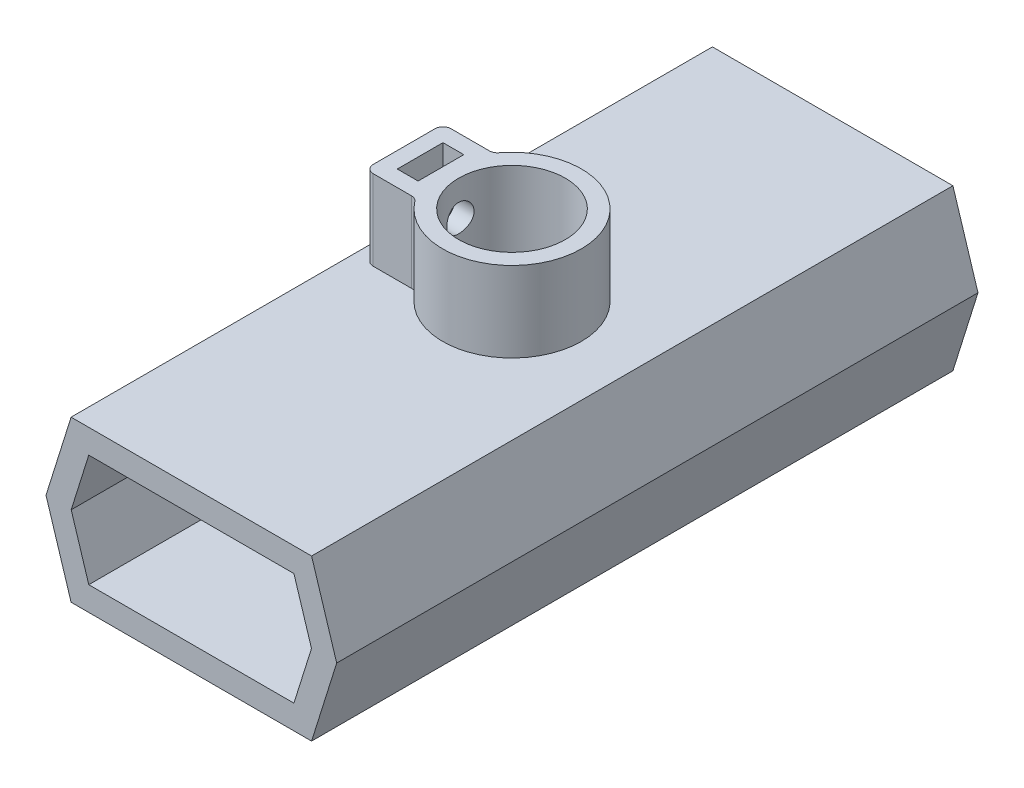
ISO-10303-21;
HEADER;
FILE_DESCRIPTION(('STEP AP214'),'2;1');
FILE_NAME('part.step','',(''),(''),'','','');
FILE_SCHEMA(('AUTOMOTIVE_DESIGN { 1 0 10303 214 1 1 1 1 }'));
ENDSEC;
DATA;
#1=APPLICATION_CONTEXT('core data for automotive mechanical design processes');
#2=APPLICATION_PROTOCOL_DEFINITION('international standard','automotive_design',2000,#1);
#3=PRODUCT_CONTEXT('',#1,'mechanical');
#4=PRODUCT('Part','Part','',(#3));
#5=PRODUCT_RELATED_PRODUCT_CATEGORY('part','',(#4));
#6=PRODUCT_DEFINITION_FORMATION('','',#4);
#7=PRODUCT_DEFINITION_CONTEXT('part definition',#1,'design');
#8=PRODUCT_DEFINITION('design','',#6,#7);
#9=PRODUCT_DEFINITION_SHAPE('','',#8);
#10=(LENGTH_UNIT() NAMED_UNIT(*) SI_UNIT(.MILLI.,.METRE.));
#11=(NAMED_UNIT(*) PLANE_ANGLE_UNIT() SI_UNIT($,.RADIAN.));
#12=(NAMED_UNIT(*) SI_UNIT($,.STERADIAN.) SOLID_ANGLE_UNIT());
#13=UNCERTAINTY_MEASURE_WITH_UNIT(LENGTH_MEASURE(1.E-05),#10,'distance_accuracy_value','');
#14=(GEOMETRIC_REPRESENTATION_CONTEXT(3) GLOBAL_UNCERTAINTY_ASSIGNED_CONTEXT((#13)) GLOBAL_UNIT_ASSIGNED_CONTEXT((#10,
#11,#12)) REPRESENTATION_CONTEXT('',''));
#15=CARTESIAN_POINT('',(0.,0.,0.));
#16=DIRECTION('',(0.,0.,1.));
#17=DIRECTION('',(1.,0.,0.));
#18=AXIS2_PLACEMENT_3D('',#15,#16,#17);
#19=CARTESIAN_POINT('',(-15.,0.,40.));
#20=DIRECTION('',(0.,-1.,0.));
#21=DIRECTION('',(1.,0.,0.));
#22=AXIS2_PLACEMENT_3D('',#19,#20,#21);
#23=PLANE('',#22);
#24=DIRECTION('',(-1.,0.,0.));
#25=VECTOR('',#24,1.);
#26=CARTESIAN_POINT('',(-15.,0.,-40.));
#27=LINE('',#26,#25);
#28=CARTESIAN_POINT('',(15.,0.,-40.));
#29=VERTEX_POINT('',#28);
#30=CARTESIAN_POINT('',(-15.,0.,-40.));
#31=VERTEX_POINT('',#30);
#32=EDGE_CURVE('E295',#29,#31,#27,.T.);
#33=ORIENTED_EDGE('',*,*,#32,.T.);
#34=DIRECTION('',(0.,0.,-1.));
#35=VECTOR('',#34,1.);
#36=CARTESIAN_POINT('',(-15.,0.,40.));
#37=LINE('',#36,#35);
#38=CARTESIAN_POINT('',(-15.,0.,40.));
#39=VERTEX_POINT('',#38);
#40=EDGE_CURVE('E305',#39,#31,#37,.T.);
#41=ORIENTED_EDGE('',*,*,#40,.F.);
#42=DIRECTION('',(-1.,0.,0.));
#43=VECTOR('',#42,1.);
#44=CARTESIAN_POINT('',(-15.,0.,40.));
#45=LINE('',#44,#43);
#46=CARTESIAN_POINT('',(15.,0.,40.));
#47=VERTEX_POINT('',#46);
#48=EDGE_CURVE('E303',#47,#39,#45,.T.);
#49=ORIENTED_EDGE('',*,*,#48,.F.);
#50=DIRECTION('',(0.,0.,-1.));
#51=VECTOR('',#50,1.);
#52=CARTESIAN_POINT('',(15.,0.,40.));
#53=LINE('',#52,#51);
#54=EDGE_CURVE('E319',#47,#29,#53,.T.);
#55=ORIENTED_EDGE('',*,*,#54,.T.);
#56=EDGE_LOOP('',(#33,#41,#49,#55));
#57=FACE_BOUND('',#56,.T.);
#58=DIRECTION('',(-1.,0.,0.));
#59=VECTOR('',#58,1.);
#60=CARTESIAN_POINT('',(0.,0.,-4.85550595548645));
#61=LINE('',#60,#59);
#62=CARTESIAN_POINT('',(-7.67043349526366,0.,-4.85550595548645));
#63=VERTEX_POINT('',#62);
#64=CARTESIAN_POINT('',(-12.461589548446,0.,-4.85550595548645));
#65=VERTEX_POINT('',#64);
#66=EDGE_CURVE('E405',#63,#65,#61,.T.);
#67=ORIENTED_EDGE('',*,*,#66,.F.);
#68=CARTESIAN_POINT('',(-7.67043349526366,0.,-5.85550595548645));
#69=DIRECTION('',(0.,-1.,0.));
#70=DIRECTION('',(1.,0.,0.));
#71=AXIS2_PLACEMENT_3D('',#68,#69,#70);
#72=CIRCLE('',#71,1.);
#73=CARTESIAN_POINT('',(-6.87556992062494,0.,-5.24871777357076));
#74=VERTEX_POINT('',#73);
#75=EDGE_CURVE('E351',#63,#74,#72,.F.);
#76=ORIENTED_EDGE('',*,*,#75,.T.);
#77=CARTESIAN_POINT('',(0.,0.,0.));
#78=DIRECTION('',(0.,-1.,0.));
#79=DIRECTION('',(1.,0.,0.));
#80=AXIS2_PLACEMENT_3D('',#77,#78,#79);
#81=CIRCLE('',#80,8.65);
#82=CARTESIAN_POINT('',(-6.87556992062494,0.,5.24871777357076));
#83=VERTEX_POINT('',#82);
#84=EDGE_CURVE('E334',#83,#74,#81,.F.);
#85=ORIENTED_EDGE('',*,*,#84,.F.);
#86=CARTESIAN_POINT('',(-7.67043349526366,0.,5.85550595548645));
#87=DIRECTION('',(0.,-1.,0.));
#88=DIRECTION('',(1.,0.,0.));
#89=AXIS2_PLACEMENT_3D('',#86,#87,#88);
#90=CIRCLE('',#89,1.);
#91=CARTESIAN_POINT('',(-7.67043349526366,0.,4.85550595548645));
#92=VERTEX_POINT('',#91);
#93=EDGE_CURVE('E349',#83,#92,#90,.F.);
#94=ORIENTED_EDGE('',*,*,#93,.T.);
#95=DIRECTION('',(1.,0.,0.));
#96=VECTOR('',#95,1.);
#97=CARTESIAN_POINT('',(0.,0.,4.85550595548645));
#98=LINE('',#97,#96);
#99=CARTESIAN_POINT('',(-12.461589548446,0.,4.85550595548645));
#100=VERTEX_POINT('',#99);
#101=EDGE_CURVE('E379',#100,#92,#98,.T.);
#102=ORIENTED_EDGE('',*,*,#101,.F.);
#103=CARTESIAN_POINT('',(-12.461589548446,0.,3.85550595548645));
#104=DIRECTION('',(0.,-1.,0.));
#105=DIRECTION('',(1.,0.,0.));
#106=AXIS2_PLACEMENT_3D('',#103,#104,#105);
#107=CIRCLE('',#106,1.);
#108=CARTESIAN_POINT('',(-13.461589548446,0.,3.85550595548645));
#109=VERTEX_POINT('',#108);
#110=EDGE_CURVE('E45',#100,#109,#107,.T.);
#111=ORIENTED_EDGE('',*,*,#110,.T.);
#112=DIRECTION('',(0.,0.,1.));
#113=VECTOR('',#112,1.);
#114=CARTESIAN_POINT('',(-13.461589548446,0.,0.));
#115=LINE('',#114,#113);
#116=CARTESIAN_POINT('',(-13.461589548446,0.,-3.85550595548645));
#117=VERTEX_POINT('',#116);
#118=EDGE_CURVE('E378',#117,#109,#115,.T.);
#119=ORIENTED_EDGE('',*,*,#118,.F.);
#120=CARTESIAN_POINT('',(-12.461589548446,0.,-3.85550595548645));
#121=DIRECTION('',(0.,-1.,0.));
#122=DIRECTION('',(1.,0.,0.));
#123=AXIS2_PLACEMENT_3D('',#120,#121,#122);
#124=CIRCLE('',#123,1.);
#125=EDGE_CURVE('E372',#117,#65,#124,.T.);
#126=ORIENTED_EDGE('',*,*,#125,.T.);
#127=EDGE_LOOP('',(#67,#76,#85,#94,#102,#111,#119,#126));
#128=FACE_BOUND('',#127,.T.);
#129=ADVANCED_FACE('F37',(#57,#128),#23,.F.);
#130=CARTESIAN_POINT('',(0.,10.,0.));
#131=DIRECTION('',(0.,-1.,0.));
#132=DIRECTION('',(1.,0.,0.));
#133=AXIS2_PLACEMENT_3D('',#130,#131,#132);
#134=CYLINDRICAL_SURFACE('',#133,8.65);
#135=ORIENTED_EDGE('',*,*,#84,.T.);
#136=DIRECTION('',(0.,-1.,0.));
#137=VECTOR('',#136,1.);
#138=CARTESIAN_POINT('',(-6.87556992062495,10.,-5.24871777357076));
#139=LINE('',#138,#137);
#140=CARTESIAN_POINT('',(-6.87556992062495,10.,-5.24871777357076));
#141=VERTEX_POINT('',#140);
#142=EDGE_CURVE('E356',#74,#141,#139,.F.);
#143=ORIENTED_EDGE('',*,*,#142,.T.);
#144=CARTESIAN_POINT('',(0.,10.,0.));
#145=DIRECTION('',(0.,1.,0.));
#146=DIRECTION('',(-1.,0.,0.));
#147=AXIS2_PLACEMENT_3D('',#144,#145,#146);
#148=CIRCLE('',#147,8.65);
#149=CARTESIAN_POINT('',(-6.87556992062495,10.,5.24871777357076));
#150=VERTEX_POINT('',#149);
#151=EDGE_CURVE('E227',#150,#141,#148,.T.);
#152=ORIENTED_EDGE('',*,*,#151,.F.);
#153=DIRECTION('',(0.,-1.,0.));
#154=VECTOR('',#153,1.);
#155=CARTESIAN_POINT('',(-6.87556992062495,10.,5.24871777357076));
#156=LINE('',#155,#154);
#157=EDGE_CURVE('E353',#150,#83,#156,.T.);
#158=ORIENTED_EDGE('',*,*,#157,.T.);
#159=EDGE_LOOP('',(#135,#143,#152,#158));
#160=FACE_BOUND('',#159,.T.);
#161=ADVANCED_FACE('F437',(#160),#134,.T.);
#162=CARTESIAN_POINT('',(-18.130448736,-10.,40.));
#163=DIRECTION('',(0.954331820555923,-0.298748684138387,0.));
#164=DIRECTION('',(0.298748684138387,0.954331820555923,0.));
#165=AXIS2_PLACEMENT_3D('',#162,#163,#164);
#166=PLANE('',#165);
#167=DIRECTION('',(-0.298748684138387,-0.954331820555923,0.));
#168=VECTOR('',#167,1.);
#169=CARTESIAN_POINT('',(-18.130448736,-10.,-40.));
#170=LINE('',#169,#168);
#171=CARTESIAN_POINT('',(-18.130448736,-10.,-40.));
#172=VERTEX_POINT('',#171);
#173=EDGE_CURVE('E280',#31,#172,#170,.T.);
#174=ORIENTED_EDGE('',*,*,#173,.T.);
#175=DIRECTION('',(0.,0.,-1.));
#176=VECTOR('',#175,1.);
#177=CARTESIAN_POINT('',(-18.130448736,-10.,40.));
#178=LINE('',#177,#176);
#179=CARTESIAN_POINT('',(-18.130448736,-10.,40.));
#180=VERTEX_POINT('',#179);
#181=EDGE_CURVE('E331',#180,#172,#178,.T.);
#182=ORIENTED_EDGE('',*,*,#181,.F.);
#183=DIRECTION('',(-0.298748684138387,-0.954331820555923,0.));
#184=VECTOR('',#183,1.);
#185=CARTESIAN_POINT('',(-18.130448736,-10.,40.));
#186=LINE('',#185,#184);
#187=EDGE_CURVE('E291',#39,#180,#186,.T.);
#188=ORIENTED_EDGE('',*,*,#187,.F.);
#189=ORIENTED_EDGE('',*,*,#40,.T.);
#190=EDGE_LOOP('',(#174,#182,#188,#189));
#191=FACE_BOUND('',#190,.T.);
#192=ADVANCED_FACE('F444',(#191),#166,.F.);
#193=CARTESIAN_POINT('',(-15.,-20.,40.));
#194=DIRECTION('',(0.954331820555923,0.298748684138387,0.));
#195=DIRECTION('',(-0.298748684138387,0.954331820555923,0.));
#196=AXIS2_PLACEMENT_3D('',#193,#194,#195);
#197=PLANE('',#196);
#198=DIRECTION('',(0.298748684138387,-0.954331820555923,0.));
#199=VECTOR('',#198,1.);
#200=CARTESIAN_POINT('',(-15.,-20.,-40.));
#201=LINE('',#200,#199);
#202=CARTESIAN_POINT('',(-15.,-20.,-40.));
#203=VERTEX_POINT('',#202);
#204=EDGE_CURVE('E308',#172,#203,#201,.T.);
#205=ORIENTED_EDGE('',*,*,#204,.T.);
#206=DIRECTION('',(0.,0.,-1.));
#207=VECTOR('',#206,1.);
#208=CARTESIAN_POINT('',(-15.,-20.,40.));
#209=LINE('',#208,#207);
#210=CARTESIAN_POINT('',(-15.,-20.,40.));
#211=VERTEX_POINT('',#210);
#212=EDGE_CURVE('E328',#211,#203,#209,.T.);
#213=ORIENTED_EDGE('',*,*,#212,.F.);
#214=DIRECTION('',(0.298748684138387,-0.954331820555923,0.));
#215=VECTOR('',#214,1.);
#216=CARTESIAN_POINT('',(-15.,-20.,40.));
#217=LINE('',#216,#215);
#218=EDGE_CURVE('E294',#180,#211,#217,.T.);
#219=ORIENTED_EDGE('',*,*,#218,.F.);
#220=ORIENTED_EDGE('',*,*,#181,.T.);
#221=EDGE_LOOP('',(#205,#213,#219,#220));
#222=FACE_BOUND('',#221,.T.);
#223=ADVANCED_FACE('F542',(#222),#197,.F.);
#224=CARTESIAN_POINT('',(15.,-20.,40.));
#225=DIRECTION('',(0.,1.,0.));
#226=DIRECTION('',(0.,0.,1.));
#227=AXIS2_PLACEMENT_3D('',#224,#225,#226);
#228=PLANE('',#227);
#229=CARTESIAN_POINT('',(0.,-20.,0.));
#230=DIRECTION('',(0.,1.,0.));
#231=DIRECTION('',(-1.,0.,0.));
#232=AXIS2_PLACEMENT_3D('',#229,#230,#231);
#233=CIRCLE('',#232,6.65);
#234=CARTESIAN_POINT('',(-6.65,-20.,0.));
#235=VERTEX_POINT('',#234);
#236=EDGE_CURVE('E235',#235,#235,#233,.T.);
#237=ORIENTED_EDGE('',*,*,#236,.T.);
#238=EDGE_LOOP('',(#237));
#239=FACE_BOUND('',#238,.T.);
#240=DIRECTION('',(1.,0.,0.));
#241=VECTOR('',#240,1.);
#242=CARTESIAN_POINT('',(15.,-20.,-40.));
#243=LINE('',#242,#241);
#244=CARTESIAN_POINT('',(15.,-20.,-40.));
#245=VERTEX_POINT('',#244);
#246=EDGE_CURVE('E310',#203,#245,#243,.T.);
#247=ORIENTED_EDGE('',*,*,#246,.T.);
#248=DIRECTION('',(0.,0.,-1.));
#249=VECTOR('',#248,1.);
#250=CARTESIAN_POINT('',(15.,-20.,40.));
#251=LINE('',#250,#249);
#252=CARTESIAN_POINT('',(15.,-20.,40.));
#253=VERTEX_POINT('',#252);
#254=EDGE_CURVE('E325',#253,#245,#251,.T.);
#255=ORIENTED_EDGE('',*,*,#254,.F.);
#256=DIRECTION('',(1.,0.,0.));
#257=VECTOR('',#256,1.);
#258=CARTESIAN_POINT('',(15.,-20.,40.));
#259=LINE('',#258,#257);
#260=EDGE_CURVE('E297',#211,#253,#259,.T.);
#261=ORIENTED_EDGE('',*,*,#260,.F.);
#262=ORIENTED_EDGE('',*,*,#212,.T.);
#263=EDGE_LOOP('',(#247,#255,#261,#262));
#264=FACE_BOUND('',#263,.T.);
#265=ADVANCED_FACE('F539',(#239,#264),#228,.F.);
#266=CARTESIAN_POINT('',(18.130448736,-10.,40.));
#267=DIRECTION('',(-0.954331820555923,0.298748684138387,0.));
#268=DIRECTION('',(-0.298748684138387,-0.954331820555923,0.));
#269=AXIS2_PLACEMENT_3D('',#266,#267,#268);
#270=PLANE('',#269);
#271=DIRECTION('',(0.298748684138387,0.954331820555923,0.));
#272=VECTOR('',#271,1.);
#273=CARTESIAN_POINT('',(18.130448736,-10.,-40.));
#274=LINE('',#273,#272);
#275=CARTESIAN_POINT('',(18.130448736,-10.,-40.));
#276=VERTEX_POINT('',#275);
#277=EDGE_CURVE('E312',#245,#276,#274,.T.);
#278=ORIENTED_EDGE('',*,*,#277,.T.);
#279=DIRECTION('',(0.,0.,-1.));
#280=VECTOR('',#279,1.);
#281=CARTESIAN_POINT('',(18.130448736,-10.,40.));
#282=LINE('',#281,#280);
#283=CARTESIAN_POINT('',(18.130448736,-10.,40.));
#284=VERTEX_POINT('',#283);
#285=EDGE_CURVE('E322',#284,#276,#282,.T.);
#286=ORIENTED_EDGE('',*,*,#285,.F.);
#287=DIRECTION('',(0.298748684138387,0.954331820555923,0.));
#288=VECTOR('',#287,1.);
#289=CARTESIAN_POINT('',(18.130448736,-10.,40.));
#290=LINE('',#289,#288);
#291=EDGE_CURVE('E299',#253,#284,#290,.T.);
#292=ORIENTED_EDGE('',*,*,#291,.F.);
#293=ORIENTED_EDGE('',*,*,#254,.T.);
#294=EDGE_LOOP('',(#278,#286,#292,#293));
#295=FACE_BOUND('',#294,.T.);
#296=ADVANCED_FACE('F534',(#295),#270,.F.);
#297=CARTESIAN_POINT('',(15.,0.,40.));
#298=DIRECTION('',(-0.954331820555923,-0.298748684138387,0.));
#299=DIRECTION('',(0.298748684138387,-0.954331820555923,0.));
#300=AXIS2_PLACEMENT_3D('',#297,#298,#299);
#301=PLANE('',#300);
#302=DIRECTION('',(-0.298748684138387,0.954331820555923,0.));
#303=VECTOR('',#302,1.);
#304=CARTESIAN_POINT('',(15.,0.,-40.));
#305=LINE('',#304,#303);
#306=EDGE_CURVE('E314',#276,#29,#305,.T.);
#307=ORIENTED_EDGE('',*,*,#306,.T.);
#308=ORIENTED_EDGE('',*,*,#54,.F.);
#309=DIRECTION('',(-0.298748684138387,0.954331820555923,0.));
#310=VECTOR('',#309,1.);
#311=CARTESIAN_POINT('',(15.,0.,40.));
#312=LINE('',#311,#310);
#313=EDGE_CURVE('E301',#284,#47,#312,.T.);
#314=ORIENTED_EDGE('',*,*,#313,.F.);
#315=ORIENTED_EDGE('',*,*,#285,.T.);
#316=EDGE_LOOP('',(#307,#308,#314,#315));
#317=FACE_BOUND('',#316,.T.);
#318=ADVANCED_FACE('F509',(#317),#301,.F.);
#319=CARTESIAN_POINT('',(0.,0.,40.));
#320=DIRECTION('',(0.,0.,-1.));
#321=DIRECTION('',(-1.,0.,0.));
#322=AXIS2_PLACEMENT_3D('',#319,#320,#321);
#323=PLANE('',#322);
#324=DIRECTION('',(-1.,0.,0.));
#325=VECTOR('',#324,1.);
#326=CARTESIAN_POINT('',(12.7955739269394,-17.,40.));
#327=LINE('',#326,#325);
#328=CARTESIAN_POINT('',(12.7955739269394,-17.,40.));
#329=VERTEX_POINT('',#328);
#330=CARTESIAN_POINT('',(-12.7955739269394,-17.,40.));
#331=VERTEX_POINT('',#330);
#332=EDGE_CURVE('E259',#329,#331,#327,.T.);
#333=ORIENTED_EDGE('',*,*,#332,.T.);
#334=DIRECTION('',(-0.298748684138387,0.954331820555923,0.));
#335=VECTOR('',#334,1.);
#336=CARTESIAN_POINT('',(-12.7955739269394,-17.,40.));
#337=LINE('',#336,#335);
#338=CARTESIAN_POINT('',(-14.9868880421394,-10.,40.));
#339=VERTEX_POINT('',#338);
#340=EDGE_CURVE('E243',#331,#339,#337,.T.);
#341=ORIENTED_EDGE('',*,*,#340,.T.);
#342=DIRECTION('',(0.298748684138387,0.954331820555923,0.));
#343=VECTOR('',#342,1.);
#344=CARTESIAN_POINT('',(-14.9868880421394,-10.,40.));
#345=LINE('',#344,#343);
#346=CARTESIAN_POINT('',(-12.7955739269394,-3.,40.));
#347=VERTEX_POINT('',#346);
#348=EDGE_CURVE('E246',#339,#347,#345,.T.);
#349=ORIENTED_EDGE('',*,*,#348,.T.);
#350=DIRECTION('',(1.,0.,0.));
#351=VECTOR('',#350,1.);
#352=CARTESIAN_POINT('',(-12.7955739269394,-3.,40.));
#353=LINE('',#352,#351);
#354=CARTESIAN_POINT('',(12.7955739269394,-3.,40.));
#355=VERTEX_POINT('',#354);
#356=EDGE_CURVE('E250',#347,#355,#353,.T.);
#357=ORIENTED_EDGE('',*,*,#356,.T.);
#358=DIRECTION('',(0.298748684138387,-0.954331820555923,0.));
#359=VECTOR('',#358,1.);
#360=CARTESIAN_POINT('',(12.7955739269394,-3.,40.));
#361=LINE('',#360,#359);
#362=CARTESIAN_POINT('',(14.9868880421394,-10.,40.));
#363=VERTEX_POINT('',#362);
#364=EDGE_CURVE('E253',#355,#363,#361,.T.);
#365=ORIENTED_EDGE('',*,*,#364,.T.);
#366=DIRECTION('',(-0.298748684138387,-0.954331820555923,0.));
#367=VECTOR('',#366,1.);
#368=CARTESIAN_POINT('',(14.9868880421394,-10.,40.));
#369=LINE('',#368,#367);
#370=EDGE_CURVE('E256',#363,#329,#369,.T.);
#371=ORIENTED_EDGE('',*,*,#370,.T.);
#372=EDGE_LOOP('',(#333,#341,#349,#357,#365,#371));
#373=FACE_BOUND('',#372,.T.);
#374=ORIENTED_EDGE('',*,*,#187,.T.);
#375=ORIENTED_EDGE('',*,*,#218,.T.);
#376=ORIENTED_EDGE('',*,*,#260,.T.);
#377=ORIENTED_EDGE('',*,*,#291,.T.);
#378=ORIENTED_EDGE('',*,*,#313,.T.);
#379=ORIENTED_EDGE('',*,*,#48,.T.);
#380=EDGE_LOOP('',(#374,#375,#376,#377,#378,#379));
#381=FACE_BOUND('',#380,.T.);
#382=ADVANCED_FACE('F507',(#373,#381),#323,.F.);
#383=CARTESIAN_POINT('',(0.,0.,-40.));
#384=DIRECTION('',(0.,0.,-1.));
#385=DIRECTION('',(-1.,0.,0.));
#386=AXIS2_PLACEMENT_3D('',#383,#384,#385);
#387=PLANE('',#386);
#388=DIRECTION('',(-0.298748684138387,0.954331820555923,0.));
#389=VECTOR('',#388,1.);
#390=CARTESIAN_POINT('',(-12.7955739269394,-17.,-40.));
#391=LINE('',#390,#389);
#392=CARTESIAN_POINT('',(-12.7955739269394,-17.,-40.));
#393=VERTEX_POINT('',#392);
#394=CARTESIAN_POINT('',(-14.9868880421394,-10.,-40.));
#395=VERTEX_POINT('',#394);
#396=EDGE_CURVE('E242',#393,#395,#391,.T.);
#397=ORIENTED_EDGE('',*,*,#396,.F.);
#398=DIRECTION('',(-1.,0.,0.));
#399=VECTOR('',#398,1.);
#400=CARTESIAN_POINT('',(12.7955739269394,-17.,-40.));
#401=LINE('',#400,#399);
#402=CARTESIAN_POINT('',(12.7955739269394,-17.,-40.));
#403=VERTEX_POINT('',#402);
#404=EDGE_CURVE('E247',#403,#393,#401,.T.);
#405=ORIENTED_EDGE('',*,*,#404,.F.);
#406=DIRECTION('',(-0.298748684138387,-0.954331820555923,0.));
#407=VECTOR('',#406,1.);
#408=CARTESIAN_POINT('',(14.9868880421394,-10.,-40.));
#409=LINE('',#408,#407);
#410=CARTESIAN_POINT('',(14.9868880421394,-10.,-40.));
#411=VERTEX_POINT('',#410);
#412=EDGE_CURVE('E273',#411,#403,#409,.T.);
#413=ORIENTED_EDGE('',*,*,#412,.F.);
#414=DIRECTION('',(0.298748684138387,-0.954331820555923,0.));
#415=VECTOR('',#414,1.);
#416=CARTESIAN_POINT('',(12.7955739269394,-3.,-40.));
#417=LINE('',#416,#415);
#418=CARTESIAN_POINT('',(12.7955739269394,-3.,-40.));
#419=VERTEX_POINT('',#418);
#420=EDGE_CURVE('E270',#419,#411,#417,.T.);
#421=ORIENTED_EDGE('',*,*,#420,.F.);
#422=DIRECTION('',(1.,0.,0.));
#423=VECTOR('',#422,1.);
#424=CARTESIAN_POINT('',(-12.7955739269394,-3.,-40.));
#425=LINE('',#424,#423);
#426=CARTESIAN_POINT('',(-12.7955739269394,-3.,-40.));
#427=VERTEX_POINT('',#426);
#428=EDGE_CURVE('E267',#427,#419,#425,.T.);
#429=ORIENTED_EDGE('',*,*,#428,.F.);
#430=DIRECTION('',(0.298748684138387,0.954331820555923,0.));
#431=VECTOR('',#430,1.);
#432=CARTESIAN_POINT('',(-14.9868880421394,-10.,-40.));
#433=LINE('',#432,#431);
#434=EDGE_CURVE('E264',#395,#427,#433,.T.);
#435=ORIENTED_EDGE('',*,*,#434,.F.);
#436=EDGE_LOOP('',(#397,#405,#413,#421,#429,#435));
#437=FACE_BOUND('',#436,.T.);
#438=ORIENTED_EDGE('',*,*,#173,.F.);
#439=ORIENTED_EDGE('',*,*,#32,.F.);
#440=ORIENTED_EDGE('',*,*,#306,.F.);
#441=ORIENTED_EDGE('',*,*,#277,.F.);
#442=ORIENTED_EDGE('',*,*,#246,.F.);
#443=ORIENTED_EDGE('',*,*,#204,.F.);
#444=EDGE_LOOP('',(#438,#439,#440,#441,#442,#443));
#445=FACE_BOUND('',#444,.T.);
#446=ADVANCED_FACE('F505',(#437,#445),#387,.T.);
#447=CARTESIAN_POINT('',(-12.7955739269394,-17.,40.));
#448=DIRECTION('',(-0.954331820555923,-0.298748684138387,0.));
#449=DIRECTION('',(0.298748684138387,-0.954331820555923,0.));
#450=AXIS2_PLACEMENT_3D('',#447,#448,#449);
#451=PLANE('',#450);
#452=ORIENTED_EDGE('',*,*,#396,.T.);
#453=DIRECTION('',(0.,0.,-1.));
#454=VECTOR('',#453,1.);
#455=CARTESIAN_POINT('',(-14.9868880421394,-10.,40.));
#456=LINE('',#455,#454);
#457=EDGE_CURVE('E262',#339,#395,#456,.T.);
#458=ORIENTED_EDGE('',*,*,#457,.F.);
#459=ORIENTED_EDGE('',*,*,#340,.F.);
#460=DIRECTION('',(0.,0.,-1.));
#461=VECTOR('',#460,1.);
#462=CARTESIAN_POINT('',(-12.7955739269394,-17.,40.));
#463=LINE('',#462,#461);
#464=EDGE_CURVE('E278',#331,#393,#463,.T.);
#465=ORIENTED_EDGE('',*,*,#464,.T.);
#466=EDGE_LOOP('',(#452,#458,#459,#465));
#467=FACE_BOUND('',#466,.T.);
#468=ADVANCED_FACE('F486',(#467),#451,.F.);
#469=CARTESIAN_POINT('',(12.7955739269394,-17.,40.));
#470=DIRECTION('',(0.,-1.,0.));
#471=DIRECTION('',(0.,0.,-1.));
#472=AXIS2_PLACEMENT_3D('',#469,#470,#471);
#473=PLANE('',#472);
#474=CARTESIAN_POINT('',(0.,-17.,0.));
#475=DIRECTION('',(0.,-1.,0.));
#476=DIRECTION('',(0.,0.,-1.));
#477=AXIS2_PLACEMENT_3D('',#474,#475,#476);
#478=CIRCLE('',#477,6.65);
#479=CARTESIAN_POINT('',(0.,-17.,-6.65));
#480=VERTEX_POINT('',#479);
#481=EDGE_CURVE('E239',#480,#480,#478,.T.);
#482=ORIENTED_EDGE('',*,*,#481,.T.);
#483=EDGE_LOOP('',(#482));
#484=FACE_BOUND('',#483,.T.);
#485=ORIENTED_EDGE('',*,*,#404,.T.);
#486=ORIENTED_EDGE('',*,*,#464,.F.);
#487=ORIENTED_EDGE('',*,*,#332,.F.);
#488=DIRECTION('',(0.,0.,-1.));
#489=VECTOR('',#488,1.);
#490=CARTESIAN_POINT('',(12.7955739269394,-17.,40.));
#491=LINE('',#490,#489);
#492=EDGE_CURVE('E281',#329,#403,#491,.T.);
#493=ORIENTED_EDGE('',*,*,#492,.T.);
#494=EDGE_LOOP('',(#485,#486,#487,#493));
#495=FACE_BOUND('',#494,.T.);
#496=ADVANCED_FACE('F482',(#484,#495),#473,.F.);
#497=CARTESIAN_POINT('',(14.9868880421394,-10.,40.));
#498=DIRECTION('',(0.954331820555923,-0.298748684138387,0.));
#499=DIRECTION('',(0.298748684138387,0.954331820555923,0.));
#500=AXIS2_PLACEMENT_3D('',#497,#498,#499);
#501=PLANE('',#500);
#502=ORIENTED_EDGE('',*,*,#412,.T.);
#503=ORIENTED_EDGE('',*,*,#492,.F.);
#504=ORIENTED_EDGE('',*,*,#370,.F.);
#505=DIRECTION('',(0.,0.,-1.));
#506=VECTOR('',#505,1.);
#507=CARTESIAN_POINT('',(14.9868880421394,-10.,40.));
#508=LINE('',#507,#506);
#509=EDGE_CURVE('E283',#363,#411,#508,.T.);
#510=ORIENTED_EDGE('',*,*,#509,.T.);
#511=EDGE_LOOP('',(#502,#503,#504,#510));
#512=FACE_BOUND('',#511,.T.);
#513=ADVANCED_FACE('F485',(#512),#501,.F.);
#514=CARTESIAN_POINT('',(12.7955739269394,-3.,40.));
#515=DIRECTION('',(0.954331820555923,0.298748684138387,0.));
#516=DIRECTION('',(-0.298748684138387,0.954331820555923,0.));
#517=AXIS2_PLACEMENT_3D('',#514,#515,#516);
#518=PLANE('',#517);
#519=ORIENTED_EDGE('',*,*,#420,.T.);
#520=ORIENTED_EDGE('',*,*,#509,.F.);
#521=ORIENTED_EDGE('',*,*,#364,.F.);
#522=DIRECTION('',(0.,0.,-1.));
#523=VECTOR('',#522,1.);
#524=CARTESIAN_POINT('',(12.7955739269394,-3.,40.));
#525=LINE('',#524,#523);
#526=EDGE_CURVE('E285',#355,#419,#525,.T.);
#527=ORIENTED_EDGE('',*,*,#526,.T.);
#528=EDGE_LOOP('',(#519,#520,#521,#527));
#529=FACE_BOUND('',#528,.T.);
#530=ADVANCED_FACE('F490',(#529),#518,.F.);
#531=CARTESIAN_POINT('',(-12.7955739269394,-3.,40.));
#532=DIRECTION('',(0.,1.,0.));
#533=DIRECTION('',(-1.,0.,0.));
#534=AXIS2_PLACEMENT_3D('',#531,#532,#533);
#535=PLANE('',#534);
#536=CARTESIAN_POINT('',(0.,-3.,0.));
#537=DIRECTION('',(0.,1.,0.));
#538=DIRECTION('',(-1.,0.,0.));
#539=AXIS2_PLACEMENT_3D('',#536,#537,#538);
#540=CIRCLE('',#539,6.65);
#541=CARTESIAN_POINT('',(-6.65,-3.,0.));
#542=VERTEX_POINT('',#541);
#543=EDGE_CURVE('E238',#542,#542,#540,.T.);
#544=ORIENTED_EDGE('',*,*,#543,.T.);
#545=EDGE_LOOP('',(#544));
#546=FACE_BOUND('',#545,.T.);
#547=ORIENTED_EDGE('',*,*,#428,.T.);
#548=ORIENTED_EDGE('',*,*,#526,.F.);
#549=ORIENTED_EDGE('',*,*,#356,.F.);
#550=DIRECTION('',(0.,0.,-1.));
#551=VECTOR('',#550,1.);
#552=CARTESIAN_POINT('',(-12.7955739269394,-3.,40.));
#553=LINE('',#552,#551);
#554=EDGE_CURVE('E287',#347,#427,#553,.T.);
#555=ORIENTED_EDGE('',*,*,#554,.T.);
#556=EDGE_LOOP('',(#547,#548,#549,#555));
#557=FACE_BOUND('',#556,.T.);
#558=ADVANCED_FACE('F494',(#546,#557),#535,.F.);
#559=CARTESIAN_POINT('',(-14.9868880421394,-10.,40.));
#560=DIRECTION('',(-0.954331820555923,0.298748684138387,0.));
#561=DIRECTION('',(-0.298748684138387,-0.954331820555923,0.));
#562=AXIS2_PLACEMENT_3D('',#559,#560,#561);
#563=PLANE('',#562);
#564=ORIENTED_EDGE('',*,*,#434,.T.);
#565=ORIENTED_EDGE('',*,*,#554,.F.);
#566=ORIENTED_EDGE('',*,*,#348,.F.);
#567=ORIENTED_EDGE('',*,*,#457,.T.);
#568=EDGE_LOOP('',(#564,#565,#566,#567));
#569=FACE_BOUND('',#568,.T.);
#570=ADVANCED_FACE('F498',(#569),#563,.F.);
#571=CARTESIAN_POINT('',(0.,-20.,0.));
#572=DIRECTION('',(0.,1.,0.));
#573=DIRECTION('',(-1.,0.,0.));
#574=AXIS2_PLACEMENT_3D('',#571,#572,#573);
#575=CYLINDRICAL_SURFACE('',#574,6.65);
#576=CARTESIAN_POINT('',(-6.65,3.98467840121392,0.));
#577=CARTESIAN_POINT('',(-6.64999846288474,3.98468090659545,0.0938566019093911));
#578=CARTESIAN_POINT('',(-6.64799327694206,3.99247722251695,0.187740796494141));
#579=CARTESIAN_POINT('',(-6.64018863345844,4.02340698044077,0.372813869582888));
#580=CARTESIAN_POINT('',(-6.63438713337203,4.04654867886772,0.464001269499549));
#581=CARTESIAN_POINT('',(-6.61963159420754,4.10737464671073,0.640981793265625));
#582=CARTESIAN_POINT('',(-6.61068143521243,4.14504102287611,0.726781403803893));
#583=CARTESIAN_POINT('',(-6.5905793371364,4.23378305467132,0.89084464128081));
#584=CARTESIAN_POINT('',(-6.57942729940969,4.28485931110741,0.969107930352961));
#585=CARTESIAN_POINT('',(-6.55586235964077,4.40012879447121,1.11755636953394));
#586=CARTESIAN_POINT('',(-6.54342929921283,4.46455585466091,1.1875567568069));
#587=CARTESIAN_POINT('',(-6.51883601795243,4.60419771990331,1.31588583056865));
#588=CARTESIAN_POINT('',(-6.50667582946536,4.67941379612267,1.37421313978787));
#589=CARTESIAN_POINT('',(-6.48380090955579,4.83994650801201,1.47841986753864));
#590=CARTESIAN_POINT('',(-6.4731117180036,4.92540254136188,1.52409065866378));
#591=CARTESIAN_POINT('',(-6.45468384975293,5.10309698621248,1.60034557365601));
#592=CARTESIAN_POINT('',(-6.44694467763619,5.19533425578442,1.63093223096536));
#593=CARTESIAN_POINT('',(-6.43550060509725,5.38193633753783,1.67551655161871));
#594=CARTESIAN_POINT('',(-6.43171481980235,5.47621647589808,1.68984735454172));
#595=CARTESIAN_POINT('',(-6.42836419830776,5.66591289564242,1.70255116210366));
#596=CARTESIAN_POINT('',(-6.4287986419293,5.76132898040253,1.70092688946329));
#597=CARTESIAN_POINT('',(-6.43376678867655,5.94802009338716,1.68203201220464));
#598=CARTESIAN_POINT('',(-6.43819595283773,6.0393387221455,1.66516039704835));
#599=CARTESIAN_POINT('',(-6.45048762490474,6.21780428782848,1.61688708127688));
#600=CARTESIAN_POINT('',(-6.45835038731881,6.30495091498088,1.58548430355964));
#601=CARTESIAN_POINT('',(-6.47671793050963,6.47365865324831,1.50870502618911));
#602=CARTESIAN_POINT('',(-6.48724956713025,6.55515156384865,1.46318536394478));
#603=CARTESIAN_POINT('',(-6.50975328927254,6.70948443978765,1.35956449225307));
#604=CARTESIAN_POINT('',(-6.52172563720909,6.7823228239524,1.30146098920647));
#605=CARTESIAN_POINT('',(-6.54620030271268,6.91956324650529,1.17226389489307));
#606=CARTESIAN_POINT('',(-6.55870776881752,6.98364832266702,1.10083414480617));
#607=CARTESIAN_POINT('',(-6.58252152732714,7.09899199111034,0.948090594427674));
#608=CARTESIAN_POINT('',(-6.59382777966253,7.1502501555965,0.866776464612551));
#609=CARTESIAN_POINT('',(-6.61402572682412,7.23860897798769,0.696107338227578));
#610=CARTESIAN_POINT('',(-6.62290827373093,7.27565620649508,0.606723527201375));
#611=CARTESIAN_POINT('',(-6.63719161379936,7.33410936991488,0.422718544634361));
#612=CARTESIAN_POINT('',(-6.64259310426194,7.35551843746947,0.328098426120263));
#613=CARTESIAN_POINT('',(-6.64920178868564,7.38159898333887,0.139015068501554));
#614=CARTESIAN_POINT('',(-6.65051706210423,7.38670186304274,0.0446150222875574));
#615=CARTESIAN_POINT('',(-6.64911391004205,7.38121110269612,-0.143690776795976));
#616=CARTESIAN_POINT('',(-6.64639586537964,7.37061894454192,-0.237596575491349));
#617=CARTESIAN_POINT('',(-6.63730092753068,7.33439382434715,-0.420735662794735));
#618=CARTESIAN_POINT('',(-6.63098174558941,7.30899796054072,-0.51001897648695));
#619=CARTESIAN_POINT('',(-6.61539818044067,7.24415863812377,-0.683052210830743));
#620=CARTESIAN_POINT('',(-6.60613349217835,7.20471372445588,-0.76680155726488));
#621=CARTESIAN_POINT('',(-6.58542957257133,7.11207187967631,-0.928092641964601));
#622=CARTESIAN_POINT('',(-6.57395351930755,7.05863562157657,-1.00549207457124));
#623=CARTESIAN_POINT('',(-6.55015500567333,6.93983216592095,-1.15037791902352));
#624=CARTESIAN_POINT('',(-6.53783239246634,6.87446281043413,-1.21786253392523));
#625=CARTESIAN_POINT('',(-6.51333765403794,6.73164213594895,-1.34279430611121));
#626=CARTESIAN_POINT('',(-6.50117757591576,6.65392303514092,-1.39993822874975));
#627=CARTESIAN_POINT('',(-6.47873704545176,6.48974590838496,-1.50037493125693));
#628=CARTESIAN_POINT('',(-6.4684565108069,6.40328826534521,-1.54366831768675));
#629=CARTESIAN_POINT('',(-6.45105428937019,6.22454370015322,-1.6148504212822));
#630=CARTESIAN_POINT('',(-6.44391400011319,6.13229491021619,-1.64283010341285));
#631=CARTESIAN_POINT('',(-6.43358697749437,5.94419087120494,-1.68282300676666));
#632=CARTESIAN_POINT('',(-6.43039933203717,5.84833645941087,-1.6948399115385));
#633=CARTESIAN_POINT('',(-6.42841027445216,5.65883394130452,-1.70236712587117));
#634=CARTESIAN_POINT('',(-6.42947983895942,5.56520617326802,-1.69836296670652));
#635=CARTESIAN_POINT('',(-6.43558512706177,5.38000849753844,-1.67507792535199));
#636=CARTESIAN_POINT('',(-6.44062076378968,5.28843854481911,-1.65579737775417));
#637=CARTESIAN_POINT('',(-6.45401724773204,5.11051131134116,-1.60277757015415));
#638=CARTESIAN_POINT('',(-6.46235622365906,5.02412396407902,-1.56913330014411));
#639=CARTESIAN_POINT('',(-6.48142198508277,4.85815707965863,-1.48841566738036));
#640=CARTESIAN_POINT('',(-6.49214911648393,4.77857853101207,-1.44134035897397));
#641=CARTESIAN_POINT('',(-6.51514707463024,4.62615140234856,-1.33359162670635));
#642=CARTESIAN_POINT('',(-6.5274519554508,4.55354477502152,-1.27258314019539));
#643=CARTESIAN_POINT('',(-6.55202013136922,4.41944184007342,-1.1393476063316));
#644=CARTESIAN_POINT('',(-6.56428341581711,4.3579481938712,-1.06711787931496));
#645=CARTESIAN_POINT('',(-6.5876674897672,4.24666378055794,-0.911818528356858));
#646=CARTESIAN_POINT('',(-6.59876186117952,4.19712004167025,-0.828567597970671));
#647=CARTESIAN_POINT('',(-6.61827611861448,4.11280986424619,-0.654640775999783));
#648=CARTESIAN_POINT('',(-6.62669785437666,4.07803319971142,-0.563970074571091));
#649=CARTESIAN_POINT('',(-6.63872424724753,4.02920031266575,-0.394597710537516));
#650=CARTESIAN_POINT('',(-6.64292303023616,4.01254156055911,-0.316678378954705));
#651=CARTESIAN_POINT('',(-6.64856144456607,3.99027999866,-0.159179222040427));
#652=CARTESIAN_POINT('',(-6.65000130362336,3.98467627640652,-0.0795995342995433));
#653=CARTESIAN_POINT('',(-6.65,3.98467840121392,0.));
#654=B_SPLINE_CURVE_WITH_KNOTS('',3,(#576,#577,#578,#579,#580,#581,#582,#583,#584,#585,#586,
#587,#588,#589,#590,#591,#592,#593,#594,#595,#596,#597,#598,#599,#600,#601,#602,#603,#604,#605,
#606,#607,#608,#609,#610,#611,#612,#613,#614,#615,#616,#617,#618,#619,#620,#621,#622,#623,#624,
#625,#626,#627,#628,#629,#630,#631,#632,#633,#634,#635,#636,#637,#638,#639,#640,#641,#642,#643,
#644,#645,#646,#647,#648,#649,#650,#651,#652,#653),.UNSPECIFIED.,.T.,.F.,(4,2,2,2,2,2,2,2,2,2,2,
2,2,2,2,2,2,2,2,2,2,2,2,2,2,2,2,2,2,2,2,2,2,2,2,2,2,2,4),(0.,0.281278033997819,
0.562707529666572,0.843791428445935,1.12488792284789,1.41140204268547,1.69794994751423,
1.98897293543032,2.27994702817936,2.56484375021519,2.84969185570148,3.12729531681324,
3.40491935818932,3.68545638078032,3.96604457866993,4.25501352782869,4.54399211322162,
4.83404677508333,5.12404331714166,5.40630122734394,5.68853248897718,5.9663630730686,
6.24422244039082,6.52718638661269,6.81020155362106,7.1005048553423,7.39079544197285,
7.67934242238391,7.96782280651454,8.24762778678021,8.52742663876922,8.8054031126461,
9.08341987533069,9.36899925078208,9.65464692851928,9.94577221524081,10.2366955715763,
10.4752664156516,10.7138175677222),.UNSPECIFIED.);
#655=CARTESIAN_POINT('',(-6.65,3.98467840121392,0.));
#656=VERTEX_POINT('',#655);
#657=EDGE_CURVE('E387',#656,#656,#654,.T.);
#658=ORIENTED_EDGE('',*,*,#657,.T.);
#659=EDGE_LOOP('',(#658));
#660=FACE_BOUND('',#659,.T.);
#661=ORIENTED_EDGE('',*,*,#543,.F.);
#662=EDGE_LOOP('',(#661));
#663=FACE_BOUND('',#662,.T.);
#664=CARTESIAN_POINT('',(0.,10.,0.));
#665=DIRECTION('',(0.,1.,0.));
#666=DIRECTION('',(-1.,0.,0.));
#667=AXIS2_PLACEMENT_3D('',#664,#665,#666);
#668=CIRCLE('',#667,6.65);
#669=CARTESIAN_POINT('',(-6.65,10.,0.));
#670=VERTEX_POINT('',#669);
#671=EDGE_CURVE('E224',#670,#670,#668,.T.);
#672=ORIENTED_EDGE('',*,*,#671,.T.);
#673=EDGE_LOOP('',(#672));
#674=FACE_BOUND('',#673,.T.);
#675=ADVANCED_FACE('F479',(#660,#663,#674),#575,.F.);
#676=ORIENTED_EDGE('',*,*,#236,.F.);
#677=EDGE_LOOP('',(#676));
#678=FACE_BOUND('',#677,.T.);
#679=ORIENTED_EDGE('',*,*,#481,.F.);
#680=EDGE_LOOP('',(#679));
#681=FACE_BOUND('',#680,.T.);
#682=ADVANCED_FACE('F475',(#678,#681),#575,.F.);
#683=CARTESIAN_POINT('',(0.,10.,0.));
#684=DIRECTION('',(0.,1.,0.));
#685=DIRECTION('',(-1.,0.,0.));
#686=AXIS2_PLACEMENT_3D('',#683,#684,#685);
#687=PLANE('',#686);
#688=DIRECTION('',(-1.,0.,0.));
#689=VECTOR('',#688,1.);
#690=CARTESIAN_POINT('',(0.,10.,-4.85550595548645));
#691=LINE('',#690,#689);
#692=CARTESIAN_POINT('',(-7.67043349526367,10.,-4.85550595548645));
#693=VERTEX_POINT('',#692);
#694=CARTESIAN_POINT('',(-12.461589548446,10.,-4.85550595548645));
#695=VERTEX_POINT('',#694);
#696=EDGE_CURVE('E218',#693,#695,#691,.T.);
#697=ORIENTED_EDGE('',*,*,#696,.T.);
#698=CARTESIAN_POINT('',(-12.461589548446,10.,-3.85550595548645));
#699=DIRECTION('',(0.,1.,0.));
#700=DIRECTION('',(-1.,0.,0.));
#701=AXIS2_PLACEMENT_3D('',#698,#699,#700);
#702=CIRCLE('',#701,1.);
#703=CARTESIAN_POINT('',(-13.461589548446,10.,-3.85550595548645));
#704=VERTEX_POINT('',#703);
#705=EDGE_CURVE('E364',#695,#704,#702,.T.);
#706=ORIENTED_EDGE('',*,*,#705,.T.);
#707=DIRECTION('',(0.,0.,1.));
#708=VECTOR('',#707,1.);
#709=CARTESIAN_POINT('',(-13.461589548446,10.,0.));
#710=LINE('',#709,#708);
#711=CARTESIAN_POINT('',(-13.461589548446,10.,3.85550595548645));
#712=VERTEX_POINT('',#711);
#713=EDGE_CURVE('E393',#704,#712,#710,.T.);
#714=ORIENTED_EDGE('',*,*,#713,.T.);
#715=CARTESIAN_POINT('',(-12.461589548446,10.,3.85550595548645));
#716=DIRECTION('',(0.,1.,0.));
#717=DIRECTION('',(-1.,0.,0.));
#718=AXIS2_PLACEMENT_3D('',#715,#716,#717);
#719=CIRCLE('',#718,1.);
#720=CARTESIAN_POINT('',(-12.461589548446,10.,4.85550595548645));
#721=VERTEX_POINT('',#720);
#722=EDGE_CURVE('E59',#712,#721,#719,.T.);
#723=ORIENTED_EDGE('',*,*,#722,.T.);
#724=DIRECTION('',(1.,0.,0.));
#725=VECTOR('',#724,1.);
#726=CARTESIAN_POINT('',(0.,10.,4.85550595548645));
#727=LINE('',#726,#725);
#728=CARTESIAN_POINT('',(-7.67043349526367,10.,4.85550595548645));
#729=VERTEX_POINT('',#728);
#730=EDGE_CURVE('E391',#721,#729,#727,.T.);
#731=ORIENTED_EDGE('',*,*,#730,.T.);
#732=CARTESIAN_POINT('',(-7.67043349526367,10.,5.85550595548645));
#733=DIRECTION('',(0.,1.,0.));
#734=DIRECTION('',(-1.,0.,0.));
#735=AXIS2_PLACEMENT_3D('',#732,#733,#734);
#736=CIRCLE('',#735,1.);
#737=EDGE_CURVE('E11',#729,#150,#736,.F.);
#738=ORIENTED_EDGE('',*,*,#737,.T.);
#739=ORIENTED_EDGE('',*,*,#151,.T.);
#740=CARTESIAN_POINT('',(-7.67043349526367,10.,-5.85550595548645));
#741=DIRECTION('',(0.,1.,0.));
#742=DIRECTION('',(-1.,0.,0.));
#743=AXIS2_PLACEMENT_3D('',#740,#741,#742);
#744=CIRCLE('',#743,1.);
#745=EDGE_CURVE('E370',#141,#693,#744,.F.);
#746=ORIENTED_EDGE('',*,*,#745,.T.);
#747=EDGE_LOOP('',(#697,#706,#714,#723,#731,#738,#739,#746));
#748=FACE_BOUND('',#747,.T.);
#749=ORIENTED_EDGE('',*,*,#671,.F.);
#750=EDGE_LOOP('',(#749));
#751=FACE_BOUND('',#750,.T.);
#752=DIRECTION('',(1.,0.,0.));
#753=VECTOR('',#752,1.);
#754=CARTESIAN_POINT('',(0.,10.,-2.85));
#755=LINE('',#754,#753);
#756=CARTESIAN_POINT('',(-11.461589548446,10.,-2.85));
#757=VERTEX_POINT('',#756);
#758=CARTESIAN_POINT('',(-8.86158954844601,10.,-2.85));
#759=VERTEX_POINT('',#758);
#760=EDGE_CURVE('E210',#757,#759,#755,.T.);
#761=ORIENTED_EDGE('',*,*,#760,.T.);
#762=DIRECTION('',(0.,0.,1.));
#763=VECTOR('',#762,1.);
#764=CARTESIAN_POINT('',(-8.86158954844601,10.,0.));
#765=LINE('',#764,#763);
#766=CARTESIAN_POINT('',(-8.86158954844601,10.,2.85));
#767=VERTEX_POINT('',#766);
#768=EDGE_CURVE('E198',#759,#767,#765,.T.);
#769=ORIENTED_EDGE('',*,*,#768,.T.);
#770=DIRECTION('',(1.,0.,0.));
#771=VECTOR('',#770,1.);
#772=CARTESIAN_POINT('',(0.,10.,2.85));
#773=LINE('',#772,#771);
#774=CARTESIAN_POINT('',(-11.461589548446,10.,2.85));
#775=VERTEX_POINT('',#774);
#776=EDGE_CURVE('E209',#775,#767,#773,.T.);
#777=ORIENTED_EDGE('',*,*,#776,.F.);
#778=DIRECTION('',(0.,0.,1.));
#779=VECTOR('',#778,1.);
#780=CARTESIAN_POINT('',(-11.461589548446,10.,0.));
#781=LINE('',#780,#779);
#782=EDGE_CURVE('E216',#757,#775,#781,.T.);
#783=ORIENTED_EDGE('',*,*,#782,.F.);
#784=EDGE_LOOP('',(#761,#769,#777,#783));
#785=FACE_BOUND('',#784,.T.);
#786=ADVANCED_FACE('F214',(#748,#751,#785),#687,.T.);
#787=CARTESIAN_POINT('',(0.,10.,-2.85));
#788=DIRECTION('',(0.,0.,-1.));
#789=DIRECTION('',(-1.,0.,0.));
#790=AXIS2_PLACEMENT_3D('',#787,#788,#789);
#791=PLANE('',#790);
#792=DIRECTION('',(1.,0.,0.));
#793=VECTOR('',#792,1.);
#794=CARTESIAN_POINT('',(0.,0.,-2.85));
#795=LINE('',#794,#793);
#796=CARTESIAN_POINT('',(-11.461589548446,0.,-2.85));
#797=VERTEX_POINT('',#796);
#798=CARTESIAN_POINT('',(-8.86158954844601,0.,-2.85));
#799=VERTEX_POINT('',#798);
#800=EDGE_CURVE('E222',#797,#799,#795,.T.);
#801=ORIENTED_EDGE('',*,*,#800,.T.);
#802=DIRECTION('',(0.,-1.,0.));
#803=VECTOR('',#802,1.);
#804=CARTESIAN_POINT('',(-8.86158954844601,10.,-2.85));
#805=LINE('',#804,#803);
#806=EDGE_CURVE('E203',#759,#799,#805,.T.);
#807=ORIENTED_EDGE('',*,*,#806,.F.);
#808=ORIENTED_EDGE('',*,*,#760,.F.);
#809=DIRECTION('',(0.,-1.,0.));
#810=VECTOR('',#809,1.);
#811=CARTESIAN_POINT('',(-11.461589548446,10.,-2.85));
#812=LINE('',#811,#810);
#813=EDGE_CURVE('E402',#757,#797,#812,.T.);
#814=ORIENTED_EDGE('',*,*,#813,.T.);
#815=EDGE_LOOP('',(#801,#807,#808,#814));
#816=FACE_BOUND('',#815,.T.);
#817=ADVANCED_FACE('F220',(#816),#791,.F.);
#818=CARTESIAN_POINT('',(-8.86158954844601,10.,0.));
#819=DIRECTION('',(1.,0.,0.));
#820=DIRECTION('',(0.,1.,0.));
#821=AXIS2_PLACEMENT_3D('',#818,#819,#820);
#822=PLANE('',#821);
#823=CARTESIAN_POINT('',(-8.86158954844601,5.68467840121392,0.));
#824=DIRECTION('',(1.,0.,0.));
#825=DIRECTION('',(0.,1.,0.));
#826=AXIS2_PLACEMENT_3D('',#823,#824,#825);
#827=CIRCLE('',#826,1.7);
#828=CARTESIAN_POINT('',(-8.86158954844601,7.38467840121392,0.));
#829=VERTEX_POINT('',#828);
#830=EDGE_CURVE('E343',#829,#829,#827,.T.);
#831=ORIENTED_EDGE('',*,*,#830,.T.);
#832=EDGE_LOOP('',(#831));
#833=FACE_BOUND('',#832,.T.);
#834=DIRECTION('',(0.,0.,1.));
#835=VECTOR('',#834,1.);
#836=CARTESIAN_POINT('',(-8.86158954844601,0.,0.));
#837=LINE('',#836,#835);
#838=CARTESIAN_POINT('',(-8.86158954844601,0.,2.85));
#839=VERTEX_POINT('',#838);
#840=EDGE_CURVE('E409',#799,#839,#837,.T.);
#841=ORIENTED_EDGE('',*,*,#840,.T.);
#842=DIRECTION('',(0.,-1.,0.));
#843=VECTOR('',#842,1.);
#844=CARTESIAN_POINT('',(-8.86158954844601,10.,2.85));
#845=LINE('',#844,#843);
#846=EDGE_CURVE('E205',#767,#839,#845,.T.);
#847=ORIENTED_EDGE('',*,*,#846,.F.);
#848=ORIENTED_EDGE('',*,*,#768,.F.);
#849=ORIENTED_EDGE('',*,*,#806,.T.);
#850=EDGE_LOOP('',(#841,#847,#848,#849));
#851=FACE_BOUND('',#850,.T.);
#852=ADVANCED_FACE('F201',(#833,#851),#822,.F.);
#853=CARTESIAN_POINT('',(0.,10.,2.85));
#854=DIRECTION('',(0.,0.,-1.));
#855=DIRECTION('',(-1.,0.,0.));
#856=AXIS2_PLACEMENT_3D('',#853,#854,#855);
#857=PLANE('',#856);
#858=DIRECTION('',(1.,0.,0.));
#859=VECTOR('',#858,1.);
#860=CARTESIAN_POINT('',(0.,0.,2.85));
#861=LINE('',#860,#859);
#862=CARTESIAN_POINT('',(-11.461589548446,0.,2.85));
#863=VERTEX_POINT('',#862);
#864=EDGE_CURVE('E411',#863,#839,#861,.T.);
#865=ORIENTED_EDGE('',*,*,#864,.F.);
#866=DIRECTION('',(0.,-1.,0.));
#867=VECTOR('',#866,1.);
#868=CARTESIAN_POINT('',(-11.461589548446,10.,2.85));
#869=LINE('',#868,#867);
#870=EDGE_CURVE('E229',#775,#863,#869,.T.);
#871=ORIENTED_EDGE('',*,*,#870,.F.);
#872=ORIENTED_EDGE('',*,*,#776,.T.);
#873=ORIENTED_EDGE('',*,*,#846,.T.);
#874=EDGE_LOOP('',(#865,#871,#872,#873));
#875=FACE_BOUND('',#874,.T.);
#876=ADVANCED_FACE('F423',(#875),#857,.T.);
#877=CARTESIAN_POINT('',(-13.461589548446,10.,0.));
#878=DIRECTION('',(1.,0.,0.));
#879=DIRECTION('',(0.,1.,0.));
#880=AXIS2_PLACEMENT_3D('',#877,#878,#879);
#881=PLANE('',#880);
#882=CARTESIAN_POINT('',(-13.461589548446,5.68467840121392,0.));
#883=DIRECTION('',(-1.,0.,0.));
#884=DIRECTION('',(0.,-1.,0.));
#885=AXIS2_PLACEMENT_3D('',#882,#883,#884);
#886=CIRCLE('',#885,1.7);
#887=CARTESIAN_POINT('',(-13.461589548446,3.98467840121392,0.));
#888=VERTEX_POINT('',#887);
#889=EDGE_CURVE('E344',#888,#888,#886,.T.);
#890=ORIENTED_EDGE('',*,*,#889,.F.);
#891=EDGE_LOOP('',(#890));
#892=FACE_BOUND('',#891,.T.);
#893=ORIENTED_EDGE('',*,*,#713,.F.);
#894=DIRECTION('',(0.,-1.,0.));
#895=VECTOR('',#894,1.);
#896=CARTESIAN_POINT('',(-13.461589548446,10.,-3.85550595548645));
#897=LINE('',#896,#895);
#898=EDGE_CURVE('E360',#704,#117,#897,.T.);
#899=ORIENTED_EDGE('',*,*,#898,.T.);
#900=ORIENTED_EDGE('',*,*,#118,.T.);
#901=DIRECTION('',(0.,-1.,0.));
#902=VECTOR('',#901,1.);
#903=CARTESIAN_POINT('',(-13.461589548446,10.,3.85550595548645));
#904=LINE('',#903,#902);
#905=EDGE_CURVE('E358',#109,#712,#904,.F.);
#906=ORIENTED_EDGE('',*,*,#905,.T.);
#907=EDGE_LOOP('',(#893,#899,#900,#906));
#908=FACE_BOUND('',#907,.T.);
#909=ADVANCED_FACE('F385',(#892,#908),#881,.F.);
#910=CARTESIAN_POINT('',(0.,10.,4.85550595548645));
#911=DIRECTION('',(0.,0.,-1.));
#912=DIRECTION('',(-1.,0.,0.));
#913=AXIS2_PLACEMENT_3D('',#910,#911,#912);
#914=PLANE('',#913);
#915=ORIENTED_EDGE('',*,*,#730,.F.);
#916=DIRECTION('',(0.,-1.,0.));
#917=VECTOR('',#916,1.);
#918=CARTESIAN_POINT('',(-12.461589548446,10.,4.85550595548645));
#919=LINE('',#918,#917);
#920=EDGE_CURVE('E367',#721,#100,#919,.T.);
#921=ORIENTED_EDGE('',*,*,#920,.T.);
#922=ORIENTED_EDGE('',*,*,#101,.T.);
#923=DIRECTION('',(0.,1.,0.));
#924=VECTOR('',#923,1.);
#925=CARTESIAN_POINT('',(-7.67043349526367,10.,4.85550595548645));
#926=LINE('',#925,#924);
#927=EDGE_CURVE('E52',#92,#729,#926,.T.);
#928=ORIENTED_EDGE('',*,*,#927,.T.);
#929=EDGE_LOOP('',(#915,#921,#922,#928));
#930=FACE_BOUND('',#929,.T.);
#931=ADVANCED_FACE('F390',(#930),#914,.F.);
#932=CARTESIAN_POINT('',(0.,10.,-4.85550595548645));
#933=DIRECTION('',(0.,0.,1.));
#934=DIRECTION('',(1.,0.,0.));
#935=AXIS2_PLACEMENT_3D('',#932,#933,#934);
#936=PLANE('',#935);
#937=ORIENTED_EDGE('',*,*,#696,.F.);
#938=DIRECTION('',(0.,1.,0.));
#939=VECTOR('',#938,1.);
#940=CARTESIAN_POINT('',(-7.67043349526366,0.,-4.85550595548645));
#941=LINE('',#940,#939);
#942=EDGE_CURVE('E346',#693,#63,#941,.F.);
#943=ORIENTED_EDGE('',*,*,#942,.T.);
#944=ORIENTED_EDGE('',*,*,#66,.T.);
#945=DIRECTION('',(0.,-1.,0.));
#946=VECTOR('',#945,1.);
#947=CARTESIAN_POINT('',(-12.461589548446,10.,-4.85550595548645));
#948=LINE('',#947,#946);
#949=EDGE_CURVE('E339',#65,#695,#948,.F.);
#950=ORIENTED_EDGE('',*,*,#949,.T.);
#951=EDGE_LOOP('',(#937,#943,#944,#950));
#952=FACE_BOUND('',#951,.T.);
#953=ADVANCED_FACE('F458',(#952),#936,.F.);
#954=CARTESIAN_POINT('',(-11.461589548446,10.,0.));
#955=DIRECTION('',(1.,0.,0.));
#956=DIRECTION('',(0.,1.,0.));
#957=AXIS2_PLACEMENT_3D('',#954,#955,#956);
#958=PLANE('',#957);
#959=CARTESIAN_POINT('',(-11.461589548446,5.68467840121392,0.));
#960=DIRECTION('',(1.,0.,0.));
#961=DIRECTION('',(0.,1.,0.));
#962=AXIS2_PLACEMENT_3D('',#959,#960,#961);
#963=CIRCLE('',#962,1.7);
#964=CARTESIAN_POINT('',(-11.461589548446,7.38467840121392,0.));
#965=VERTEX_POINT('',#964);
#966=EDGE_CURVE('E340',#965,#965,#963,.T.);
#967=ORIENTED_EDGE('',*,*,#966,.F.);
#968=EDGE_LOOP('',(#967));
#969=FACE_BOUND('',#968,.T.);
#970=DIRECTION('',(0.,0.,1.));
#971=VECTOR('',#970,1.);
#972=CARTESIAN_POINT('',(-11.461589548446,0.,0.));
#973=LINE('',#972,#971);
#974=EDGE_CURVE('E397',#797,#863,#973,.T.);
#975=ORIENTED_EDGE('',*,*,#974,.F.);
#976=ORIENTED_EDGE('',*,*,#813,.F.);
#977=ORIENTED_EDGE('',*,*,#782,.T.);
#978=ORIENTED_EDGE('',*,*,#870,.T.);
#979=EDGE_LOOP('',(#975,#976,#977,#978));
#980=FACE_BOUND('',#979,.T.);
#981=ADVANCED_FACE('F419',(#969,#980),#958,.T.);
#982=ORIENTED_EDGE('',*,*,#800,.F.);
#983=ORIENTED_EDGE('',*,*,#974,.T.);
#984=ORIENTED_EDGE('',*,*,#864,.T.);
#985=ORIENTED_EDGE('',*,*,#840,.F.);
#986=EDGE_LOOP('',(#982,#983,#984,#985));
#987=FACE_BOUND('',#986,.T.);
#988=ADVANCED_FACE('F422',(#987),#23,.F.);
#989=CARTESIAN_POINT('',(-3.46158954844601,5.68467840121392,0.));
#990=DIRECTION('',(-1.,0.,0.));
#991=DIRECTION('',(0.,-1.,0.));
#992=AXIS2_PLACEMENT_3D('',#989,#990,#991);
#993=CYLINDRICAL_SURFACE('',#992,1.7);
#994=ORIENTED_EDGE('',*,*,#966,.T.);
#995=EDGE_LOOP('',(#994));
#996=FACE_BOUND('',#995,.T.);
#997=ORIENTED_EDGE('',*,*,#889,.T.);
#998=EDGE_LOOP('',(#997));
#999=FACE_BOUND('',#998,.T.);
#1000=ADVANCED_FACE('F450',(#996,#999),#993,.F.);
#1001=ORIENTED_EDGE('',*,*,#830,.F.);
#1002=EDGE_LOOP('',(#1001));
#1003=FACE_BOUND('',#1002,.T.);
#1004=ORIENTED_EDGE('',*,*,#657,.F.);
#1005=EDGE_LOOP('',(#1004));
#1006=FACE_BOUND('',#1005,.T.);
#1007=ADVANCED_FACE('F455',(#1003,#1006),#993,.F.);
#1008=CARTESIAN_POINT('',(-7.67043349526367,10.,-5.85550595548645));
#1009=DIRECTION('',(0.,-1.,0.));
#1010=DIRECTION('',(1.,0.,0.));
#1011=AXIS2_PLACEMENT_3D('',#1008,#1009,#1010);
#1012=CYLINDRICAL_SURFACE('',#1011,1.);
#1013=ORIENTED_EDGE('',*,*,#745,.F.);
#1014=ORIENTED_EDGE('',*,*,#142,.F.);
#1015=ORIENTED_EDGE('',*,*,#75,.F.);
#1016=ORIENTED_EDGE('',*,*,#942,.F.);
#1017=EDGE_LOOP('',(#1013,#1014,#1015,#1016));
#1018=FACE_BOUND('',#1017,.T.);
#1019=ADVANCED_FACE('F555',(#1018),#1012,.F.);
#1020=CARTESIAN_POINT('',(-12.461589548446,10.,-3.85550595548645));
#1021=DIRECTION('',(0.,-1.,0.));
#1022=DIRECTION('',(1.,0.,0.));
#1023=AXIS2_PLACEMENT_3D('',#1020,#1021,#1022);
#1024=CYLINDRICAL_SURFACE('',#1023,1.);
#1025=ORIENTED_EDGE('',*,*,#705,.F.);
#1026=ORIENTED_EDGE('',*,*,#949,.F.);
#1027=ORIENTED_EDGE('',*,*,#125,.F.);
#1028=ORIENTED_EDGE('',*,*,#898,.F.);
#1029=EDGE_LOOP('',(#1025,#1026,#1027,#1028));
#1030=FACE_BOUND('',#1029,.T.);
#1031=ADVANCED_FACE('F558',(#1030),#1024,.T.);
#1032=CARTESIAN_POINT('',(-12.461589548446,10.,3.85550595548645));
#1033=DIRECTION('',(0.,-1.,0.));
#1034=DIRECTION('',(1.,0.,0.));
#1035=AXIS2_PLACEMENT_3D('',#1032,#1033,#1034);
#1036=CYLINDRICAL_SURFACE('',#1035,1.);
#1037=ORIENTED_EDGE('',*,*,#722,.F.);
#1038=ORIENTED_EDGE('',*,*,#905,.F.);
#1039=ORIENTED_EDGE('',*,*,#110,.F.);
#1040=ORIENTED_EDGE('',*,*,#920,.F.);
#1041=EDGE_LOOP('',(#1037,#1038,#1039,#1040));
#1042=FACE_BOUND('',#1041,.T.);
#1043=ADVANCED_FACE('F389',(#1042),#1036,.T.);
#1044=CARTESIAN_POINT('',(-7.67043349526367,10.,5.85550595548645));
#1045=DIRECTION('',(0.,-1.,0.));
#1046=DIRECTION('',(1.,0.,0.));
#1047=AXIS2_PLACEMENT_3D('',#1044,#1045,#1046);
#1048=CYLINDRICAL_SURFACE('',#1047,1.);
#1049=ORIENTED_EDGE('',*,*,#737,.F.);
#1050=ORIENTED_EDGE('',*,*,#927,.F.);
#1051=ORIENTED_EDGE('',*,*,#93,.F.);
#1052=ORIENTED_EDGE('',*,*,#157,.F.);
#1053=EDGE_LOOP('',(#1049,#1050,#1051,#1052));
#1054=FACE_BOUND('',#1053,.T.);
#1055=ADVANCED_FACE('F39',(#1054),#1048,.F.);
#1056=CLOSED_SHELL('',(#129,#161,#192,#223,#265,#296,#318,#382,#446,#468,#496,#513,#530,#558,
#570,#675,#682,#786,#817,#852,#876,#909,#931,#953,#981,#988,#1000,#1007,#1019,#1031,#1043,#1055));
#1057=MANIFOLD_SOLID_BREP('B2',#1056);
#1058=ADVANCED_BREP_SHAPE_REPRESENTATION('',(#18,#1057),#14);
#1059=SHAPE_DEFINITION_REPRESENTATION(#9,#1058);
ENDSEC;
END-ISO-10303-21;
